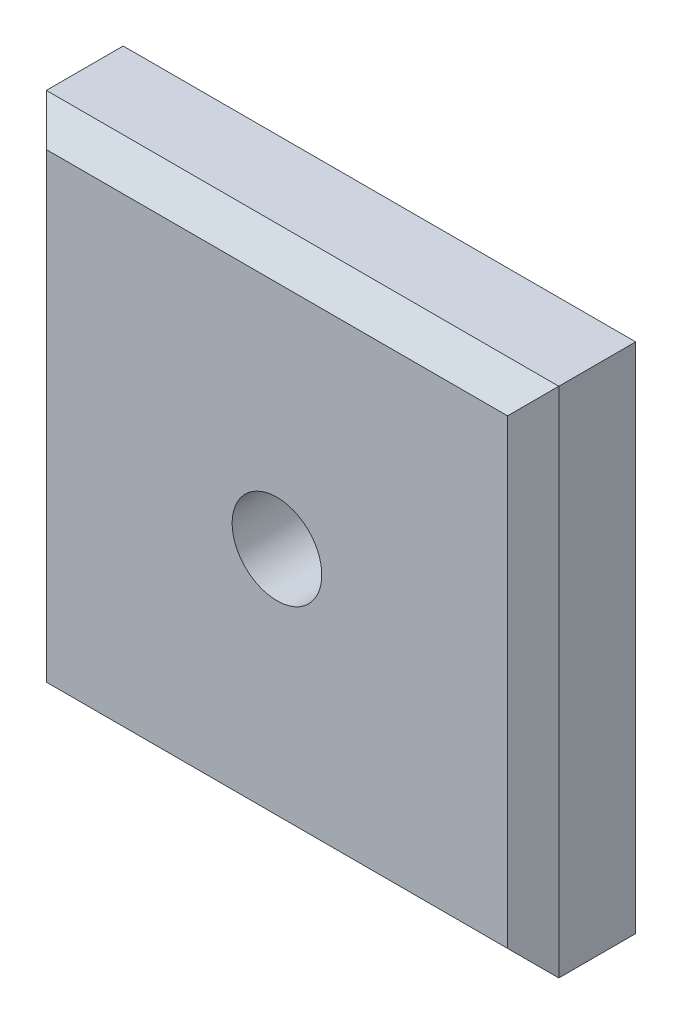
ISO-10303-21;
HEADER;
FILE_DESCRIPTION(('STEP AP214'),'2;1');
FILE_NAME('part.step','',(''),(''),'','','');
FILE_SCHEMA(('AUTOMOTIVE_DESIGN { 1 0 10303 214 1 1 1 1 }'));
ENDSEC;
DATA;
#1=APPLICATION_CONTEXT('core data for automotive mechanical design processes');
#2=APPLICATION_PROTOCOL_DEFINITION('international standard','automotive_design',2000,#1);
#3=PRODUCT_CONTEXT('',#1,'mechanical');
#4=PRODUCT('Part','Part','',(#3));
#5=PRODUCT_RELATED_PRODUCT_CATEGORY('part','',(#4));
#6=PRODUCT_DEFINITION_FORMATION('','',#4);
#7=PRODUCT_DEFINITION_CONTEXT('part definition',#1,'design');
#8=PRODUCT_DEFINITION('design','',#6,#7);
#9=PRODUCT_DEFINITION_SHAPE('','',#8);
#10=(LENGTH_UNIT() NAMED_UNIT(*) SI_UNIT(.MILLI.,.METRE.));
#11=(NAMED_UNIT(*) PLANE_ANGLE_UNIT() SI_UNIT($,.RADIAN.));
#12=(NAMED_UNIT(*) SI_UNIT($,.STERADIAN.) SOLID_ANGLE_UNIT());
#13=UNCERTAINTY_MEASURE_WITH_UNIT(LENGTH_MEASURE(1.E-05),#10,'distance_accuracy_value','');
#14=(GEOMETRIC_REPRESENTATION_CONTEXT(3) GLOBAL_UNCERTAINTY_ASSIGNED_CONTEXT((#13)) GLOBAL_UNIT_ASSIGNED_CONTEXT((#10,
#11,#12)) REPRESENTATION_CONTEXT('',''));
#15=CARTESIAN_POINT('',(0.,0.,0.));
#16=DIRECTION('',(0.,0.,1.));
#17=DIRECTION('',(1.,0.,0.));
#18=AXIS2_PLACEMENT_3D('',#15,#16,#17);
#19=CARTESIAN_POINT('',(20.,-20.,10.));
#20=DIRECTION('',(-1.,0.,0.));
#21=DIRECTION('',(0.,0.,1.));
#22=AXIS2_PLACEMENT_3D('',#19,#20,#21);
#23=PLANE('',#22);
#24=DIRECTION('',(0.,0.,-1.));
#25=VECTOR('',#24,1.);
#26=CARTESIAN_POINT('',(20.,-20.,10.));
#27=LINE('',#26,#25);
#28=CARTESIAN_POINT('',(20.,-20.,7.99999999999999));
#29=VERTEX_POINT('',#28);
#30=CARTESIAN_POINT('',(20.,-20.,2.));
#31=VERTEX_POINT('',#30);
#32=EDGE_CURVE('E171',#29,#31,#27,.T.);
#33=ORIENTED_EDGE('',*,*,#32,.T.);
#34=DIRECTION('',(0.,1.,0.));
#35=VECTOR('',#34,1.);
#36=CARTESIAN_POINT('',(20.,20.,2.));
#37=LINE('',#36,#35);
#38=CARTESIAN_POINT('',(20.,20.,2.));
#39=VERTEX_POINT('',#38);
#40=EDGE_CURVE('E122',#31,#39,#37,.T.);
#41=ORIENTED_EDGE('',*,*,#40,.T.);
#42=DIRECTION('',(0.,0.,-1.));
#43=VECTOR('',#42,1.);
#44=CARTESIAN_POINT('',(20.,20.,10.));
#45=LINE('',#44,#43);
#46=CARTESIAN_POINT('',(20.,20.,7.99999999999999));
#47=VERTEX_POINT('',#46);
#48=EDGE_CURVE('E106',#47,#39,#45,.T.);
#49=ORIENTED_EDGE('',*,*,#48,.F.);
#50=DIRECTION('',(0.,-1.,0.));
#51=VECTOR('',#50,1.);
#52=CARTESIAN_POINT('',(20.,-20.,7.99999999999999));
#53=LINE('',#52,#51);
#54=EDGE_CURVE('E119',#47,#29,#53,.T.);
#55=ORIENTED_EDGE('',*,*,#54,.T.);
#56=EDGE_LOOP('',(#33,#41,#49,#55));
#57=FACE_BOUND('',#56,.T.);
#58=ADVANCED_FACE('F35',(#57),#23,.F.);
#59=CARTESIAN_POINT('',(-20.,20.,10.));
#60=DIRECTION('',(0.,-1.,0.));
#61=DIRECTION('',(0.,0.,-1.));
#62=AXIS2_PLACEMENT_3D('',#59,#60,#61);
#63=PLANE('',#62);
#64=ORIENTED_EDGE('',*,*,#48,.T.);
#65=DIRECTION('',(-1.,0.,0.));
#66=VECTOR('',#65,1.);
#67=CARTESIAN_POINT('',(-20.,20.,2.));
#68=LINE('',#67,#66);
#69=CARTESIAN_POINT('',(-20.,20.,2.));
#70=VERTEX_POINT('',#69);
#71=EDGE_CURVE('E112',#39,#70,#68,.T.);
#72=ORIENTED_EDGE('',*,*,#71,.T.);
#73=DIRECTION('',(0.,0.,-1.));
#74=VECTOR('',#73,1.);
#75=CARTESIAN_POINT('',(-20.,20.,10.));
#76=LINE('',#75,#74);
#77=CARTESIAN_POINT('',(-20.,20.,7.99999999999999));
#78=VERTEX_POINT('',#77);
#79=EDGE_CURVE('E108',#78,#70,#76,.T.);
#80=ORIENTED_EDGE('',*,*,#79,.F.);
#81=DIRECTION('',(1.,0.,0.));
#82=VECTOR('',#81,1.);
#83=CARTESIAN_POINT('',(-20.,20.,7.99999999999999));
#84=LINE('',#83,#82);
#85=EDGE_CURVE('E103',#78,#47,#84,.T.);
#86=ORIENTED_EDGE('',*,*,#85,.T.);
#87=EDGE_LOOP('',(#64,#72,#80,#86));
#88=FACE_BOUND('',#87,.T.);
#89=ADVANCED_FACE('F105',(#88),#63,.F.);
#90=CARTESIAN_POINT('',(-20.,-20.,10.));
#91=DIRECTION('',(1.,0.,0.));
#92=DIRECTION('',(0.,0.,-1.));
#93=AXIS2_PLACEMENT_3D('',#90,#91,#92);
#94=PLANE('',#93);
#95=ORIENTED_EDGE('',*,*,#79,.T.);
#96=DIRECTION('',(0.,-1.,0.));
#97=VECTOR('',#96,1.);
#98=CARTESIAN_POINT('',(-20.,-20.,2.));
#99=LINE('',#98,#97);
#100=CARTESIAN_POINT('',(-20.,-20.,2.));
#101=VERTEX_POINT('',#100);
#102=EDGE_CURVE('E189',#70,#101,#99,.T.);
#103=ORIENTED_EDGE('',*,*,#102,.T.);
#104=DIRECTION('',(0.,0.,-1.));
#105=VECTOR('',#104,1.);
#106=CARTESIAN_POINT('',(-20.,-20.,10.));
#107=LINE('',#106,#105);
#108=CARTESIAN_POINT('',(-20.,-20.,7.99999999999999));
#109=VERTEX_POINT('',#108);
#110=EDGE_CURVE('E173',#109,#101,#107,.T.);
#111=ORIENTED_EDGE('',*,*,#110,.F.);
#112=DIRECTION('',(0.,1.,0.));
#113=VECTOR('',#112,1.);
#114=CARTESIAN_POINT('',(-20.,-20.,7.99999999999999));
#115=LINE('',#114,#113);
#116=EDGE_CURVE('E187',#109,#78,#115,.T.);
#117=ORIENTED_EDGE('',*,*,#116,.T.);
#118=EDGE_LOOP('',(#95,#103,#111,#117));
#119=FACE_BOUND('',#118,.T.);
#120=ADVANCED_FACE('F207',(#119),#94,.F.);
#121=CARTESIAN_POINT('',(-20.,-20.,10.));
#122=DIRECTION('',(0.,1.,0.));
#123=DIRECTION('',(0.,0.,1.));
#124=AXIS2_PLACEMENT_3D('',#121,#122,#123);
#125=PLANE('',#124);
#126=ORIENTED_EDGE('',*,*,#110,.T.);
#127=DIRECTION('',(1.,0.,0.));
#128=VECTOR('',#127,1.);
#129=CARTESIAN_POINT('',(20.,-20.,2.));
#130=LINE('',#129,#128);
#131=EDGE_CURVE('E193',#101,#31,#130,.T.);
#132=ORIENTED_EDGE('',*,*,#131,.T.);
#133=ORIENTED_EDGE('',*,*,#32,.F.);
#134=DIRECTION('',(-1.,0.,0.));
#135=VECTOR('',#134,1.);
#136=CARTESIAN_POINT('',(-20.,-20.,7.99999999999999));
#137=LINE('',#136,#135);
#138=EDGE_CURVE('E191',#29,#109,#137,.T.);
#139=ORIENTED_EDGE('',*,*,#138,.T.);
#140=EDGE_LOOP('',(#126,#132,#133,#139));
#141=FACE_BOUND('',#140,.T.);
#142=ADVANCED_FACE('F205',(#141),#125,.F.);
#143=CARTESIAN_POINT('',(0.,0.,10.));
#144=DIRECTION('',(0.,0.,-1.));
#145=DIRECTION('',(-1.,0.,0.));
#146=AXIS2_PLACEMENT_3D('',#143,#144,#145);
#147=PLANE('',#146);
#148=DIRECTION('',(1.,0.,0.));
#149=VECTOR('',#148,1.);
#150=CARTESIAN_POINT('',(0.,-18.,10.));
#151=LINE('',#150,#149);
#152=CARTESIAN_POINT('',(-18.,-18.,10.));
#153=VERTEX_POINT('',#152);
#154=CARTESIAN_POINT('',(18.,-18.,10.));
#155=VERTEX_POINT('',#154);
#156=EDGE_CURVE('E195',#153,#155,#151,.T.);
#157=ORIENTED_EDGE('',*,*,#156,.T.);
#158=DIRECTION('',(0.,1.,0.));
#159=VECTOR('',#158,1.);
#160=CARTESIAN_POINT('',(18.,0.,10.));
#161=LINE('',#160,#159);
#162=CARTESIAN_POINT('',(18.,18.,10.));
#163=VERTEX_POINT('',#162);
#164=EDGE_CURVE('E11',#155,#163,#161,.T.);
#165=ORIENTED_EDGE('',*,*,#164,.T.);
#166=DIRECTION('',(-1.,0.,0.));
#167=VECTOR('',#166,1.);
#168=CARTESIAN_POINT('',(0.,18.,10.));
#169=LINE('',#168,#167);
#170=CARTESIAN_POINT('',(-18.,18.,10.));
#171=VERTEX_POINT('',#170);
#172=EDGE_CURVE('E44',#163,#171,#169,.T.);
#173=ORIENTED_EDGE('',*,*,#172,.T.);
#174=DIRECTION('',(0.,-1.,0.));
#175=VECTOR('',#174,1.);
#176=CARTESIAN_POINT('',(-18.,0.,10.));
#177=LINE('',#176,#175);
#178=EDGE_CURVE('E197',#171,#153,#177,.T.);
#179=ORIENTED_EDGE('',*,*,#178,.T.);
#180=EDGE_LOOP('',(#157,#165,#173,#179));
#181=FACE_BOUND('',#180,.T.);
#182=CARTESIAN_POINT('',(0.,0.,10.));
#183=DIRECTION('',(0.,0.,-1.));
#184=DIRECTION('',(-1.,0.,0.));
#185=AXIS2_PLACEMENT_3D('',#182,#183,#184);
#186=CIRCLE('',#185,3.5);
#187=CARTESIAN_POINT('',(-3.5,0.,10.));
#188=VERTEX_POINT('',#187);
#189=EDGE_CURVE('E166',#188,#188,#186,.T.);
#190=ORIENTED_EDGE('',*,*,#189,.T.);
#191=EDGE_LOOP('',(#190));
#192=FACE_BOUND('',#191,.T.);
#193=ADVANCED_FACE('F198',(#181,#192),#147,.F.);
#194=CARTESIAN_POINT('',(0.,0.,0.));
#195=DIRECTION('',(0.,0.,-1.));
#196=DIRECTION('',(-1.,0.,0.));
#197=AXIS2_PLACEMENT_3D('',#194,#195,#196);
#198=PLANE('',#197);
#199=DIRECTION('',(1.,0.,0.));
#200=VECTOR('',#199,1.);
#201=CARTESIAN_POINT('',(20.,18.,0.));
#202=LINE('',#201,#200);
#203=CARTESIAN_POINT('',(-18.,18.,0.));
#204=VERTEX_POINT('',#203);
#205=CARTESIAN_POINT('',(18.,18.,0.));
#206=VERTEX_POINT('',#205);
#207=EDGE_CURVE('E182',#204,#206,#202,.T.);
#208=ORIENTED_EDGE('',*,*,#207,.T.);
#209=DIRECTION('',(0.,-1.,0.));
#210=VECTOR('',#209,1.);
#211=CARTESIAN_POINT('',(18.,-20.,0.));
#212=LINE('',#211,#210);
#213=CARTESIAN_POINT('',(18.,-18.,0.));
#214=VERTEX_POINT('',#213);
#215=EDGE_CURVE('E113',#206,#214,#212,.T.);
#216=ORIENTED_EDGE('',*,*,#215,.T.);
#217=DIRECTION('',(-1.,0.,0.));
#218=VECTOR('',#217,1.);
#219=CARTESIAN_POINT('',(-20.,-18.,0.));
#220=LINE('',#219,#218);
#221=CARTESIAN_POINT('',(-18.,-18.,0.));
#222=VERTEX_POINT('',#221);
#223=EDGE_CURVE('E178',#214,#222,#220,.T.);
#224=ORIENTED_EDGE('',*,*,#223,.T.);
#225=DIRECTION('',(0.,1.,0.));
#226=VECTOR('',#225,1.);
#227=CARTESIAN_POINT('',(-18.,20.,0.));
#228=LINE('',#227,#226);
#229=EDGE_CURVE('E180',#222,#204,#228,.T.);
#230=ORIENTED_EDGE('',*,*,#229,.T.);
#231=EDGE_LOOP('',(#208,#216,#224,#230));
#232=FACE_BOUND('',#231,.T.);
#233=CARTESIAN_POINT('',(0.,0.,0.));
#234=DIRECTION('',(0.,0.,-1.));
#235=DIRECTION('',(-1.,0.,0.));
#236=AXIS2_PLACEMENT_3D('',#233,#234,#235);
#237=CIRCLE('',#236,4.025);
#238=CARTESIAN_POINT('',(-4.025,0.,0.));
#239=VERTEX_POINT('',#238);
#240=EDGE_CURVE('E155',#239,#239,#237,.T.);
#241=ORIENTED_EDGE('',*,*,#240,.F.);
#242=EDGE_LOOP('',(#241));
#243=FACE_BOUND('',#242,.T.);
#244=ADVANCED_FACE('F234',(#232,#243),#198,.T.);
#245=CARTESIAN_POINT('',(0.,0.,0.));
#246=DIRECTION('',(0.,0.,-1.));
#247=DIRECTION('',(-1.,0.,0.));
#248=AXIS2_PLACEMENT_3D('',#245,#246,#247);
#249=CYLINDRICAL_SURFACE('',#248,3.49999999999999);
#250=ORIENTED_EDGE('',*,*,#189,.F.);
#251=EDGE_LOOP('',(#250));
#252=FACE_BOUND('',#251,.T.);
#253=CARTESIAN_POINT('',(0.,0.,0.525000000000025));
#254=DIRECTION('',(0.,0.,-1.));
#255=DIRECTION('',(-1.,0.,0.));
#256=AXIS2_PLACEMENT_3D('',#253,#254,#255);
#257=CIRCLE('',#256,3.49999999999999);
#258=CARTESIAN_POINT('',(-3.49999999999999,0.,0.525000000000025));
#259=VERTEX_POINT('',#258);
#260=EDGE_CURVE('E161',#259,#259,#257,.T.);
#261=ORIENTED_EDGE('',*,*,#260,.T.);
#262=EDGE_LOOP('',(#261));
#263=FACE_BOUND('',#262,.T.);
#264=ADVANCED_FACE('F237',(#252,#263),#249,.F.);
#265=CARTESIAN_POINT('',(0.,0.,0.));
#266=DIRECTION('',(0.,0.,-1.));
#267=DIRECTION('',(-1.,0.,0.));
#268=AXIS2_PLACEMENT_3D('',#265,#266,#267);
#269=CONICAL_SURFACE('',#268,4.025,0.785398163397435);
#270=ORIENTED_EDGE('',*,*,#260,.F.);
#271=EDGE_LOOP('',(#270));
#272=FACE_BOUND('',#271,.T.);
#273=ORIENTED_EDGE('',*,*,#240,.T.);
#274=EDGE_LOOP('',(#273));
#275=FACE_BOUND('',#274,.T.);
#276=ADVANCED_FACE('F243',(#272,#275),#269,.F.);
#277=CARTESIAN_POINT('',(-20.,-20.,2.));
#278=DIRECTION('',(-0.707106781186546,0.,-0.707106781186549));
#279=DIRECTION('',(0.,1.,0.));
#280=AXIS2_PLACEMENT_3D('',#277,#278,#279);
#281=PLANE('',#280);
#282=DIRECTION('',(0.577350269189626,-0.577350269189626,-0.577350269189624));
#283=VECTOR('',#282,1.);
#284=CARTESIAN_POINT('',(-6.66666666666663,6.66666666666664,-11.3333333333333));
#285=LINE('',#284,#283);
#286=EDGE_CURVE('E147',#204,#70,#285,.F.);
#287=ORIENTED_EDGE('',*,*,#286,.F.);
#288=ORIENTED_EDGE('',*,*,#229,.F.);
#289=DIRECTION('',(0.577350269189626,0.577350269189626,-0.577350269189624));
#290=VECTOR('',#289,1.);
#291=CARTESIAN_POINT('',(-20.,-20.,2.));
#292=LINE('',#291,#290);
#293=EDGE_CURVE('E134',#101,#222,#292,.T.);
#294=ORIENTED_EDGE('',*,*,#293,.F.);
#295=ORIENTED_EDGE('',*,*,#102,.F.);
#296=EDGE_LOOP('',(#287,#288,#294,#295));
#297=FACE_BOUND('',#296,.T.);
#298=ADVANCED_FACE('F210',(#297),#281,.T.);
#299=CARTESIAN_POINT('',(-20.,-20.,2.));
#300=DIRECTION('',(0.,-0.707106781186546,-0.707106781186549));
#301=DIRECTION('',(-1.,0.,0.));
#302=AXIS2_PLACEMENT_3D('',#299,#300,#301);
#303=PLANE('',#302);
#304=ORIENTED_EDGE('',*,*,#293,.T.);
#305=ORIENTED_EDGE('',*,*,#223,.F.);
#306=DIRECTION('',(0.577350269189626,-0.577350269189626,0.577350269189624));
#307=VECTOR('',#306,1.);
#308=CARTESIAN_POINT('',(6.66666666666664,-6.66666666666663,-11.3333333333333));
#309=LINE('',#308,#307);
#310=EDGE_CURVE('E141',#31,#214,#309,.F.);
#311=ORIENTED_EDGE('',*,*,#310,.F.);
#312=ORIENTED_EDGE('',*,*,#131,.F.);
#313=EDGE_LOOP('',(#304,#305,#311,#312));
#314=FACE_BOUND('',#313,.T.);
#315=ADVANCED_FACE('F213',(#314),#303,.T.);
#316=CARTESIAN_POINT('',(-20.,20.,2.));
#317=DIRECTION('',(0.,0.707106781186546,-0.707106781186549));
#318=DIRECTION('',(1.,0.,0.));
#319=AXIS2_PLACEMENT_3D('',#316,#317,#318);
#320=PLANE('',#319);
#321=ORIENTED_EDGE('',*,*,#286,.T.);
#322=ORIENTED_EDGE('',*,*,#71,.F.);
#323=DIRECTION('',(-0.577350269189626,-0.577350269189626,-0.577350269189624));
#324=VECTOR('',#323,1.);
#325=CARTESIAN_POINT('',(6.66666666666664,6.66666666666664,-11.3333333333333));
#326=LINE('',#325,#324);
#327=EDGE_CURVE('E137',#206,#39,#326,.F.);
#328=ORIENTED_EDGE('',*,*,#327,.F.);
#329=ORIENTED_EDGE('',*,*,#207,.F.);
#330=EDGE_LOOP('',(#321,#322,#328,#329));
#331=FACE_BOUND('',#330,.T.);
#332=ADVANCED_FACE('F216',(#331),#320,.T.);
#333=CARTESIAN_POINT('',(20.,-20.,2.));
#334=DIRECTION('',(0.707106781186546,0.,-0.707106781186549));
#335=DIRECTION('',(0.,-1.,0.));
#336=AXIS2_PLACEMENT_3D('',#333,#334,#335);
#337=PLANE('',#336);
#338=ORIENTED_EDGE('',*,*,#310,.T.);
#339=ORIENTED_EDGE('',*,*,#215,.F.);
#340=ORIENTED_EDGE('',*,*,#327,.T.);
#341=ORIENTED_EDGE('',*,*,#40,.F.);
#342=EDGE_LOOP('',(#338,#339,#340,#341));
#343=FACE_BOUND('',#342,.T.);
#344=ADVANCED_FACE('F214',(#343),#337,.T.);
#345=CARTESIAN_POINT('',(-18.,0.,10.));
#346=DIRECTION('',(0.707106781186549,0.,-0.707106781186546));
#347=DIRECTION('',(0.,-1.,0.));
#348=AXIS2_PLACEMENT_3D('',#345,#346,#347);
#349=PLANE('',#348);
#350=DIRECTION('',(-0.577350269189625,0.577350269189625,-0.577350269189627));
#351=VECTOR('',#350,1.);
#352=CARTESIAN_POINT('',(-12.,12.,16.));
#353=LINE('',#352,#351);
#354=EDGE_CURVE('E131',#78,#171,#353,.F.);
#355=ORIENTED_EDGE('',*,*,#354,.F.);
#356=ORIENTED_EDGE('',*,*,#116,.F.);
#357=DIRECTION('',(-0.577350269189625,-0.577350269189625,-0.577350269189627));
#358=VECTOR('',#357,1.);
#359=CARTESIAN_POINT('',(-12.,-12.,16.));
#360=LINE('',#359,#358);
#361=EDGE_CURVE('E39',#153,#109,#360,.T.);
#362=ORIENTED_EDGE('',*,*,#361,.F.);
#363=ORIENTED_EDGE('',*,*,#178,.F.);
#364=EDGE_LOOP('',(#355,#356,#362,#363));
#365=FACE_BOUND('',#364,.T.);
#366=ADVANCED_FACE('F37',(#365),#349,.F.);
#367=CARTESIAN_POINT('',(0.,-18.,10.));
#368=DIRECTION('',(0.,0.707106781186549,-0.707106781186546));
#369=DIRECTION('',(1.,0.,0.));
#370=AXIS2_PLACEMENT_3D('',#367,#368,#369);
#371=PLANE('',#370);
#372=ORIENTED_EDGE('',*,*,#361,.T.);
#373=ORIENTED_EDGE('',*,*,#138,.F.);
#374=DIRECTION('',(-0.577350269189625,0.577350269189625,0.577350269189627));
#375=VECTOR('',#374,1.);
#376=CARTESIAN_POINT('',(12.,-12.,16.));
#377=LINE('',#376,#375);
#378=EDGE_CURVE('E126',#155,#29,#377,.F.);
#379=ORIENTED_EDGE('',*,*,#378,.F.);
#380=ORIENTED_EDGE('',*,*,#156,.F.);
#381=EDGE_LOOP('',(#372,#373,#379,#380));
#382=FACE_BOUND('',#381,.T.);
#383=ADVANCED_FACE('F202',(#382),#371,.F.);
#384=CARTESIAN_POINT('',(0.,18.,10.));
#385=DIRECTION('',(0.,-0.707106781186549,-0.707106781186546));
#386=DIRECTION('',(-1.,0.,0.));
#387=AXIS2_PLACEMENT_3D('',#384,#385,#386);
#388=PLANE('',#387);
#389=ORIENTED_EDGE('',*,*,#354,.T.);
#390=ORIENTED_EDGE('',*,*,#172,.F.);
#391=DIRECTION('',(0.577350269189625,0.577350269189625,-0.577350269189627));
#392=VECTOR('',#391,1.);
#393=CARTESIAN_POINT('',(12.,12.,16.));
#394=LINE('',#393,#392);
#395=EDGE_CURVE('E52',#47,#163,#394,.F.);
#396=ORIENTED_EDGE('',*,*,#395,.F.);
#397=ORIENTED_EDGE('',*,*,#85,.F.);
#398=EDGE_LOOP('',(#389,#390,#396,#397));
#399=FACE_BOUND('',#398,.T.);
#400=ADVANCED_FACE('F129',(#399),#388,.F.);
#401=CARTESIAN_POINT('',(18.,0.,10.));
#402=DIRECTION('',(-0.707106781186549,0.,-0.707106781186546));
#403=DIRECTION('',(0.,1.,0.));
#404=AXIS2_PLACEMENT_3D('',#401,#402,#403);
#405=PLANE('',#404);
#406=ORIENTED_EDGE('',*,*,#378,.T.);
#407=ORIENTED_EDGE('',*,*,#54,.F.);
#408=ORIENTED_EDGE('',*,*,#395,.T.);
#409=ORIENTED_EDGE('',*,*,#164,.F.);
#410=EDGE_LOOP('',(#406,#407,#408,#409));
#411=FACE_BOUND('',#410,.T.);
#412=ADVANCED_FACE('F124',(#411),#405,.F.);
#413=CLOSED_SHELL('',(#58,#89,#120,#142,#193,#244,#264,#276,#298,#315,#332,#344,#366,#383,#400,#412));
#414=MANIFOLD_SOLID_BREP('B2',#413);
#415=ADVANCED_BREP_SHAPE_REPRESENTATION('',(#18,#414),#14);
#416=SHAPE_DEFINITION_REPRESENTATION(#9,#415);
ENDSEC;
END-ISO-10303-21;
